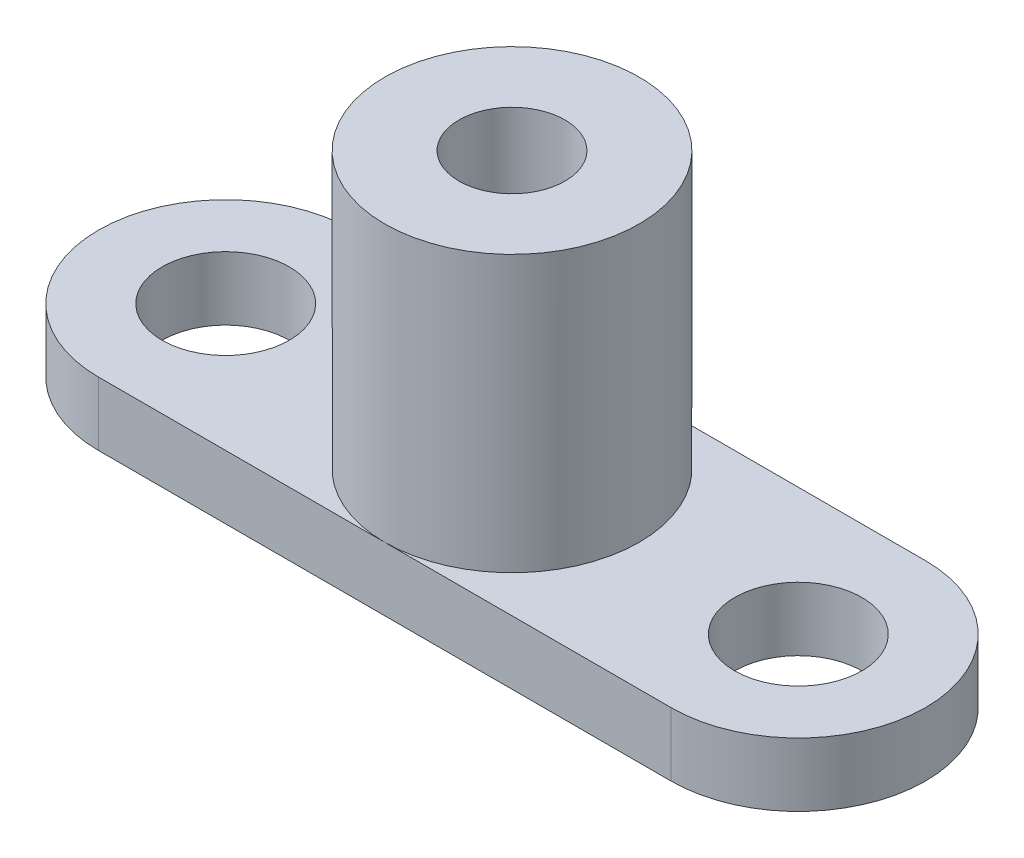
ISO-10303-21;
HEADER;
FILE_DESCRIPTION(('STEP AP214'),'2;1');
FILE_NAME('part.step','',(''),(''),'','','');
FILE_SCHEMA(('AUTOMOTIVE_DESIGN { 1 0 10303 214 1 1 1 1 }'));
ENDSEC;
DATA;
#1=APPLICATION_CONTEXT('core data for automotive mechanical design processes');
#2=APPLICATION_PROTOCOL_DEFINITION('international standard','automotive_design',2000,#1);
#3=PRODUCT_CONTEXT('',#1,'mechanical');
#4=PRODUCT('Part','Part','',(#3));
#5=PRODUCT_RELATED_PRODUCT_CATEGORY('part','',(#4));
#6=PRODUCT_DEFINITION_FORMATION('','',#4);
#7=PRODUCT_DEFINITION_CONTEXT('part definition',#1,'design');
#8=PRODUCT_DEFINITION('design','',#6,#7);
#9=PRODUCT_DEFINITION_SHAPE('','',#8);
#10=(LENGTH_UNIT() NAMED_UNIT(*) SI_UNIT(.MILLI.,.METRE.));
#11=(NAMED_UNIT(*) PLANE_ANGLE_UNIT() SI_UNIT($,.RADIAN.));
#12=(NAMED_UNIT(*) SI_UNIT($,.STERADIAN.) SOLID_ANGLE_UNIT());
#13=UNCERTAINTY_MEASURE_WITH_UNIT(LENGTH_MEASURE(1.E-05),#10,'distance_accuracy_value','');
#14=(GEOMETRIC_REPRESENTATION_CONTEXT(3) GLOBAL_UNCERTAINTY_ASSIGNED_CONTEXT((#13)) GLOBAL_UNIT_ASSIGNED_CONTEXT((#10,
#11,#12)) REPRESENTATION_CONTEXT('',''));
#15=CARTESIAN_POINT('',(0.,0.,0.));
#16=DIRECTION('',(0.,0.,1.));
#17=DIRECTION('',(1.,0.,0.));
#18=AXIS2_PLACEMENT_3D('',#15,#16,#17);
#19=CARTESIAN_POINT('',(0.,3.,0.));
#20=DIRECTION('',(0.,1.,0.));
#21=DIRECTION('',(0.,0.,1.));
#22=AXIS2_PLACEMENT_3D('',#19,#20,#21);
#23=PLANE('',#22);
#24=CARTESIAN_POINT('',(13.5,3.,0.));
#25=DIRECTION('',(0.,1.,0.));
#26=DIRECTION('',(0.,0.,1.));
#27=AXIS2_PLACEMENT_3D('',#24,#25,#26);
#28=CIRCLE('',#27,3.);
#29=CARTESIAN_POINT('',(13.5,3.,3.));
#30=VERTEX_POINT('',#29);
#31=EDGE_CURVE('E151',#30,#30,#28,.T.);
#32=ORIENTED_EDGE('',*,*,#31,.F.);
#33=EDGE_LOOP('',(#32));
#34=FACE_BOUND('',#33,.T.);
#35=CARTESIAN_POINT('',(0.,3.,0.));
#36=DIRECTION('',(0.,1.,0.));
#37=DIRECTION('',(0.,0.,1.));
#38=AXIS2_PLACEMENT_3D('',#35,#36,#37);
#39=CIRCLE('',#38,6.);
#40=CARTESIAN_POINT('',(0.,3.,6.));
#41=VERTEX_POINT('',#40);
#42=CARTESIAN_POINT('',(0.,3.,-6.));
#43=VERTEX_POINT('',#42);
#44=EDGE_CURVE('E52',#41,#43,#39,.T.);
#45=ORIENTED_EDGE('',*,*,#44,.F.);
#46=DIRECTION('',(1.,0.,0.));
#47=VECTOR('',#46,1.);
#48=CARTESIAN_POINT('',(0.,3.,6.));
#49=LINE('',#48,#47);
#50=CARTESIAN_POINT('',(13.5,3.,6.));
#51=VERTEX_POINT('',#50);
#52=EDGE_CURVE('E101',#41,#51,#49,.T.);
#53=ORIENTED_EDGE('',*,*,#52,.T.);
#54=CARTESIAN_POINT('',(13.5,3.,0.));
#55=DIRECTION('',(0.,1.,0.));
#56=DIRECTION('',(0.,0.,1.));
#57=AXIS2_PLACEMENT_3D('',#54,#55,#56);
#58=CIRCLE('',#57,6.);
#59=CARTESIAN_POINT('',(13.5,3.,-6.));
#60=VERTEX_POINT('',#59);
#61=EDGE_CURVE('E100',#51,#60,#58,.T.);
#62=ORIENTED_EDGE('',*,*,#61,.T.);
#63=DIRECTION('',(1.,0.,0.));
#64=VECTOR('',#63,1.);
#65=CARTESIAN_POINT('',(0.,3.,-6.));
#66=LINE('',#65,#64);
#67=EDGE_CURVE('E65',#43,#60,#66,.T.);
#68=ORIENTED_EDGE('',*,*,#67,.F.);
#69=EDGE_LOOP('',(#45,#53,#62,#68));
#70=FACE_BOUND('',#69,.T.);
#71=ADVANCED_FACE('F41',(#34,#70),#23,.T.);
#72=CARTESIAN_POINT('',(0.,3.,-6.));
#73=DIRECTION('',(0.,0.,-1.));
#74=DIRECTION('',(-1.,0.,0.));
#75=AXIS2_PLACEMENT_3D('',#72,#73,#74);
#76=PLANE('',#75);
#77=DIRECTION('',(1.,0.,0.));
#78=VECTOR('',#77,1.);
#79=CARTESIAN_POINT('',(0.,0.,-6.));
#80=LINE('',#79,#78);
#81=CARTESIAN_POINT('',(-13.5,0.,-6.));
#82=VERTEX_POINT('',#81);
#83=CARTESIAN_POINT('',(13.5,0.,-6.));
#84=VERTEX_POINT('',#83);
#85=EDGE_CURVE('E163',#82,#84,#80,.T.);
#86=ORIENTED_EDGE('',*,*,#85,.F.);
#87=DIRECTION('',(0.,-1.,0.));
#88=VECTOR('',#87,1.);
#89=CARTESIAN_POINT('',(-13.5,3.,-6.));
#90=LINE('',#89,#88);
#91=CARTESIAN_POINT('',(-13.5,3.,-6.));
#92=VERTEX_POINT('',#91);
#93=EDGE_CURVE('E50',#92,#82,#90,.T.);
#94=ORIENTED_EDGE('',*,*,#93,.F.);
#95=EDGE_CURVE('E165',#92,#43,#66,.T.);
#96=ORIENTED_EDGE('',*,*,#95,.T.);
#97=ORIENTED_EDGE('',*,*,#67,.T.);
#98=DIRECTION('',(0.,-1.,0.));
#99=VECTOR('',#98,1.);
#100=CARTESIAN_POINT('',(13.5,3.,-6.));
#101=LINE('',#100,#99);
#102=EDGE_CURVE('E85',#60,#84,#101,.T.);
#103=ORIENTED_EDGE('',*,*,#102,.T.);
#104=EDGE_LOOP('',(#86,#94,#96,#97,#103));
#105=FACE_BOUND('',#104,.T.);
#106=ADVANCED_FACE('F43',(#105),#76,.T.);
#107=CARTESIAN_POINT('',(-13.5,3.,0.));
#108=DIRECTION('',(0.,-1.,0.));
#109=DIRECTION('',(0.,0.,-1.));
#110=AXIS2_PLACEMENT_3D('',#107,#108,#109);
#111=CYLINDRICAL_SURFACE('',#110,6.);
#112=CARTESIAN_POINT('',(-13.5,0.,0.));
#113=DIRECTION('',(0.,1.,0.));
#114=DIRECTION('',(0.,0.,1.));
#115=AXIS2_PLACEMENT_3D('',#112,#113,#114);
#116=CIRCLE('',#115,6.);
#117=CARTESIAN_POINT('',(-13.5,0.,6.));
#118=VERTEX_POINT('',#117);
#119=EDGE_CURVE('E171',#82,#118,#116,.T.);
#120=ORIENTED_EDGE('',*,*,#119,.T.);
#121=DIRECTION('',(0.,-1.,0.));
#122=VECTOR('',#121,1.);
#123=CARTESIAN_POINT('',(-13.5,3.,6.));
#124=LINE('',#123,#122);
#125=CARTESIAN_POINT('',(-13.5,3.,6.));
#126=VERTEX_POINT('',#125);
#127=EDGE_CURVE('E179',#126,#118,#124,.T.);
#128=ORIENTED_EDGE('',*,*,#127,.F.);
#129=CARTESIAN_POINT('',(-13.5,3.,0.));
#130=DIRECTION('',(0.,1.,0.));
#131=DIRECTION('',(0.,0.,1.));
#132=AXIS2_PLACEMENT_3D('',#129,#130,#131);
#133=CIRCLE('',#132,6.);
#134=EDGE_CURVE('E96',#92,#126,#133,.T.);
#135=ORIENTED_EDGE('',*,*,#134,.F.);
#136=ORIENTED_EDGE('',*,*,#93,.T.);
#137=EDGE_LOOP('',(#120,#128,#135,#136));
#138=FACE_BOUND('',#137,.T.);
#139=ADVANCED_FACE('F136',(#138),#111,.T.);
#140=CARTESIAN_POINT('',(0.,3.,6.));
#141=DIRECTION('',(0.,0.,-1.));
#142=DIRECTION('',(-1.,0.,0.));
#143=AXIS2_PLACEMENT_3D('',#140,#141,#142);
#144=PLANE('',#143);
#145=DIRECTION('',(1.,0.,0.));
#146=VECTOR('',#145,1.);
#147=CARTESIAN_POINT('',(0.,0.,6.));
#148=LINE('',#147,#146);
#149=CARTESIAN_POINT('',(13.5,0.,6.));
#150=VERTEX_POINT('',#149);
#151=EDGE_CURVE('E173',#118,#150,#148,.T.);
#152=ORIENTED_EDGE('',*,*,#151,.T.);
#153=DIRECTION('',(0.,-1.,0.));
#154=VECTOR('',#153,1.);
#155=CARTESIAN_POINT('',(13.5,3.,6.));
#156=LINE('',#155,#154);
#157=EDGE_CURVE('E107',#51,#150,#156,.T.);
#158=ORIENTED_EDGE('',*,*,#157,.F.);
#159=ORIENTED_EDGE('',*,*,#52,.F.);
#160=EDGE_CURVE('E93',#126,#41,#49,.T.);
#161=ORIENTED_EDGE('',*,*,#160,.F.);
#162=ORIENTED_EDGE('',*,*,#127,.T.);
#163=EDGE_LOOP('',(#152,#158,#159,#161,#162));
#164=FACE_BOUND('',#163,.T.);
#165=ADVANCED_FACE('F105',(#164),#144,.F.);
#166=CARTESIAN_POINT('',(13.5,3.,0.));
#167=DIRECTION('',(0.,-1.,0.));
#168=DIRECTION('',(0.,0.,-1.));
#169=AXIS2_PLACEMENT_3D('',#166,#167,#168);
#170=CYLINDRICAL_SURFACE('',#169,6.);
#171=CARTESIAN_POINT('',(13.5,0.,0.));
#172=DIRECTION('',(0.,1.,0.));
#173=DIRECTION('',(0.,0.,1.));
#174=AXIS2_PLACEMENT_3D('',#171,#172,#173);
#175=CIRCLE('',#174,6.);
#176=EDGE_CURVE('E175',#150,#84,#175,.T.);
#177=ORIENTED_EDGE('',*,*,#176,.T.);
#178=ORIENTED_EDGE('',*,*,#102,.F.);
#179=ORIENTED_EDGE('',*,*,#61,.F.);
#180=ORIENTED_EDGE('',*,*,#157,.T.);
#181=EDGE_LOOP('',(#177,#178,#179,#180));
#182=FACE_BOUND('',#181,.T.);
#183=ADVANCED_FACE('F139',(#182),#170,.T.);
#184=CARTESIAN_POINT('',(-13.5,3.,0.));
#185=DIRECTION('',(0.,1.,0.));
#186=DIRECTION('',(0.,0.,1.));
#187=AXIS2_PLACEMENT_3D('',#184,#185,#186);
#188=CIRCLE('',#187,3.);
#189=CARTESIAN_POINT('',(-13.5,3.,3.));
#190=VERTEX_POINT('',#189);
#191=EDGE_CURVE('E148',#190,#190,#188,.T.);
#192=ORIENTED_EDGE('',*,*,#191,.F.);
#193=EDGE_LOOP('',(#192));
#194=FACE_BOUND('',#193,.T.);
#195=EDGE_CURVE('E11',#43,#41,#39,.T.);
#196=ORIENTED_EDGE('',*,*,#195,.F.);
#197=ORIENTED_EDGE('',*,*,#95,.F.);
#198=ORIENTED_EDGE('',*,*,#134,.T.);
#199=ORIENTED_EDGE('',*,*,#160,.T.);
#200=EDGE_LOOP('',(#196,#197,#198,#199));
#201=FACE_BOUND('',#200,.T.);
#202=ADVANCED_FACE('F95',(#194,#201),#23,.T.);
#203=CARTESIAN_POINT('',(0.,0.,0.));
#204=DIRECTION('',(0.,1.,0.));
#205=DIRECTION('',(0.,0.,1.));
#206=AXIS2_PLACEMENT_3D('',#203,#204,#205);
#207=PLANE('',#206);
#208=CARTESIAN_POINT('',(-13.5,0.,0.));
#209=DIRECTION('',(0.,1.,0.));
#210=DIRECTION('',(0.,0.,1.));
#211=AXIS2_PLACEMENT_3D('',#208,#209,#210);
#212=CIRCLE('',#211,3.);
#213=CARTESIAN_POINT('',(-13.5,0.,3.));
#214=VERTEX_POINT('',#213);
#215=EDGE_CURVE('E45',#214,#214,#212,.T.);
#216=ORIENTED_EDGE('',*,*,#215,.T.);
#217=EDGE_LOOP('',(#216));
#218=FACE_BOUND('',#217,.T.);
#219=CARTESIAN_POINT('',(13.5,0.,0.));
#220=DIRECTION('',(0.,1.,0.));
#221=DIRECTION('',(0.,0.,1.));
#222=AXIS2_PLACEMENT_3D('',#219,#220,#221);
#223=CIRCLE('',#222,3.);
#224=CARTESIAN_POINT('',(13.5,0.,3.));
#225=VERTEX_POINT('',#224);
#226=EDGE_CURVE('E150',#225,#225,#223,.T.);
#227=ORIENTED_EDGE('',*,*,#226,.T.);
#228=EDGE_LOOP('',(#227));
#229=FACE_BOUND('',#228,.T.);
#230=CARTESIAN_POINT('',(0.,0.,0.));
#231=DIRECTION('',(0.,1.,0.));
#232=DIRECTION('',(0.,0.,1.));
#233=AXIS2_PLACEMENT_3D('',#230,#231,#232);
#234=CIRCLE('',#233,2.5);
#235=CARTESIAN_POINT('',(0.,0.,2.5));
#236=VERTEX_POINT('',#235);
#237=EDGE_CURVE('E113',#236,#236,#234,.T.);
#238=ORIENTED_EDGE('',*,*,#237,.T.);
#239=EDGE_LOOP('',(#238));
#240=FACE_BOUND('',#239,.T.);
#241=ORIENTED_EDGE('',*,*,#85,.T.);
#242=ORIENTED_EDGE('',*,*,#176,.F.);
#243=ORIENTED_EDGE('',*,*,#151,.F.);
#244=ORIENTED_EDGE('',*,*,#119,.F.);
#245=EDGE_LOOP('',(#241,#242,#243,#244));
#246=FACE_BOUND('',#245,.T.);
#247=ADVANCED_FACE('F117',(#218,#229,#240,#246),#207,.F.);
#248=CARTESIAN_POINT('',(0.,16.,0.));
#249=DIRECTION('',(0.,-1.,0.));
#250=DIRECTION('',(0.,0.,-1.));
#251=AXIS2_PLACEMENT_3D('',#248,#249,#250);
#252=CYLINDRICAL_SURFACE('',#251,6.);
#253=CARTESIAN_POINT('',(0.,16.,0.));
#254=DIRECTION('',(0.,1.,0.));
#255=DIRECTION('',(0.,0.,1.));
#256=AXIS2_PLACEMENT_3D('',#253,#254,#255);
#257=CIRCLE('',#256,6.);
#258=CARTESIAN_POINT('',(0.,16.,6.));
#259=VERTEX_POINT('',#258);
#260=EDGE_CURVE('E112',#259,#259,#257,.T.);
#261=ORIENTED_EDGE('',*,*,#260,.F.);
#262=EDGE_LOOP('',(#261));
#263=FACE_BOUND('',#262,.T.);
#264=ORIENTED_EDGE('',*,*,#44,.T.);
#265=ORIENTED_EDGE('',*,*,#195,.T.);
#266=EDGE_LOOP('',(#264,#265));
#267=FACE_BOUND('',#266,.T.);
#268=ADVANCED_FACE('F114',(#263,#267),#252,.T.);
#269=CARTESIAN_POINT('',(0.,16.,0.));
#270=DIRECTION('',(0.,1.,0.));
#271=DIRECTION('',(0.,0.,1.));
#272=AXIS2_PLACEMENT_3D('',#269,#270,#271);
#273=PLANE('',#272);
#274=CARTESIAN_POINT('',(0.,16.,0.));
#275=DIRECTION('',(0.,1.,0.));
#276=DIRECTION('',(0.,0.,1.));
#277=AXIS2_PLACEMENT_3D('',#274,#275,#276);
#278=CIRCLE('',#277,2.5);
#279=CARTESIAN_POINT('',(0.,16.,2.5));
#280=VERTEX_POINT('',#279);
#281=EDGE_CURVE('E157',#280,#280,#278,.T.);
#282=ORIENTED_EDGE('',*,*,#281,.F.);
#283=EDGE_LOOP('',(#282));
#284=FACE_BOUND('',#283,.T.);
#285=ORIENTED_EDGE('',*,*,#260,.T.);
#286=EDGE_LOOP('',(#285));
#287=FACE_BOUND('',#286,.T.);
#288=ADVANCED_FACE('F116',(#284,#287),#273,.T.);
#289=CARTESIAN_POINT('',(0.,16.,0.));
#290=DIRECTION('',(0.,1.,0.));
#291=DIRECTION('',(0.,0.,1.));
#292=AXIS2_PLACEMENT_3D('',#289,#290,#291);
#293=CYLINDRICAL_SURFACE('',#292,2.5);
#294=ORIENTED_EDGE('',*,*,#237,.F.);
#295=EDGE_LOOP('',(#294));
#296=FACE_BOUND('',#295,.T.);
#297=ORIENTED_EDGE('',*,*,#281,.T.);
#298=EDGE_LOOP('',(#297));
#299=FACE_BOUND('',#298,.T.);
#300=ADVANCED_FACE('F124',(#296,#299),#293,.F.);
#301=CARTESIAN_POINT('',(13.5,-7.,0.));
#302=DIRECTION('',(0.,1.,0.));
#303=DIRECTION('',(0.,0.,1.));
#304=AXIS2_PLACEMENT_3D('',#301,#302,#303);
#305=CYLINDRICAL_SURFACE('',#304,3.);
#306=ORIENTED_EDGE('',*,*,#31,.T.);
#307=EDGE_LOOP('',(#306));
#308=FACE_BOUND('',#307,.T.);
#309=ORIENTED_EDGE('',*,*,#226,.F.);
#310=EDGE_LOOP('',(#309));
#311=FACE_BOUND('',#310,.T.);
#312=ADVANCED_FACE('F288',(#308,#311),#305,.F.);
#313=CARTESIAN_POINT('',(-13.5,-7.,0.));
#314=DIRECTION('',(0.,1.,0.));
#315=DIRECTION('',(0.,0.,1.));
#316=AXIS2_PLACEMENT_3D('',#313,#314,#315);
#317=CYLINDRICAL_SURFACE('',#316,3.);
#318=ORIENTED_EDGE('',*,*,#191,.T.);
#319=EDGE_LOOP('',(#318));
#320=FACE_BOUND('',#319,.T.);
#321=ORIENTED_EDGE('',*,*,#215,.F.);
#322=EDGE_LOOP('',(#321));
#323=FACE_BOUND('',#322,.T.);
#324=ADVANCED_FACE('F297',(#320,#323),#317,.F.);
#325=CLOSED_SHELL('',(#71,#106,#139,#165,#183,#202,#247,#268,#288,#300,#312,#324));
#326=MANIFOLD_SOLID_BREP('B2',#325);
#327=ADVANCED_BREP_SHAPE_REPRESENTATION('',(#18,#326),#14);
#328=SHAPE_DEFINITION_REPRESENTATION(#9,#327);
ENDSEC;
END-ISO-10303-21;
